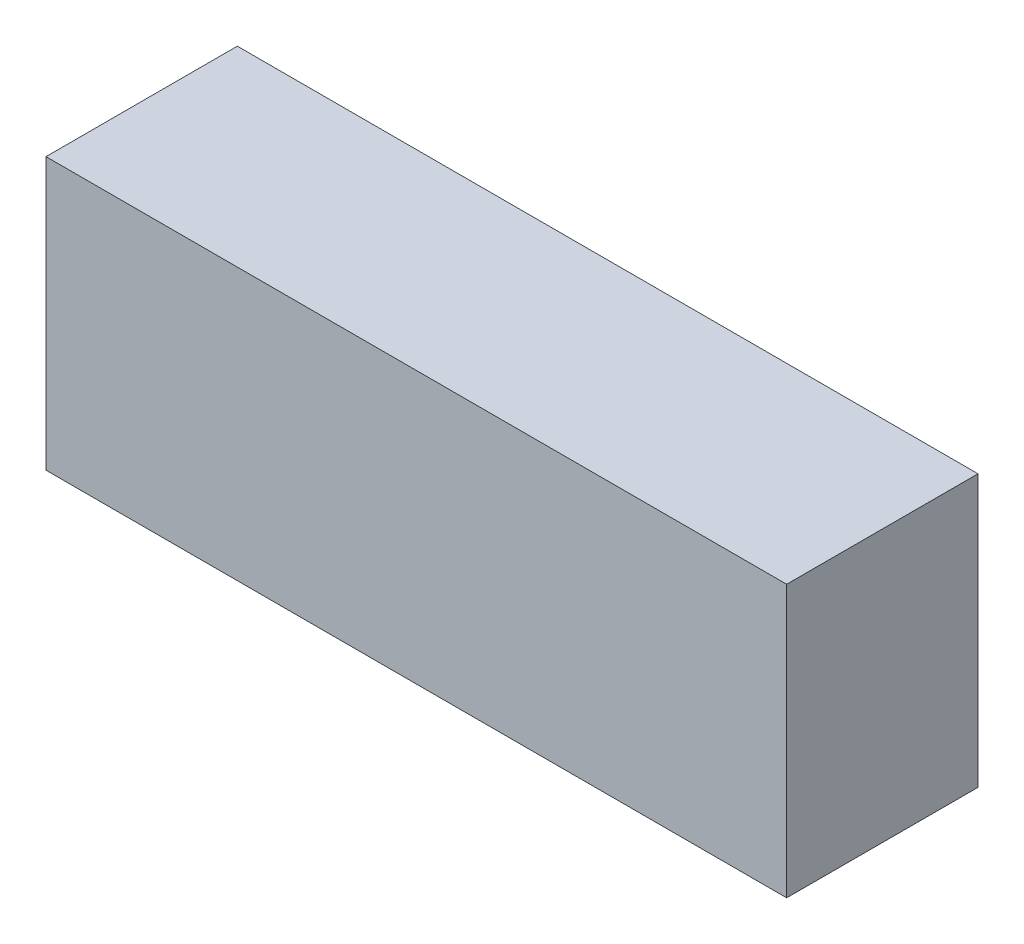
ISO-10303-21;
HEADER;
FILE_DESCRIPTION(('STEP AP214'),'2;1');
FILE_NAME('part.step','',(''),(''),'','','');
FILE_SCHEMA(('AUTOMOTIVE_DESIGN { 1 0 10303 214 1 1 1 1 }'));
ENDSEC;
DATA;
#1=APPLICATION_CONTEXT('core data for automotive mechanical design processes');
#2=APPLICATION_PROTOCOL_DEFINITION('international standard','automotive_design',2000,#1);
#3=PRODUCT_CONTEXT('',#1,'mechanical');
#4=PRODUCT('Part','Part','',(#3));
#5=PRODUCT_RELATED_PRODUCT_CATEGORY('part','',(#4));
#6=PRODUCT_DEFINITION_FORMATION('','',#4);
#7=PRODUCT_DEFINITION_CONTEXT('part definition',#1,'design');
#8=PRODUCT_DEFINITION('design','',#6,#7);
#9=PRODUCT_DEFINITION_SHAPE('','',#8);
#10=(LENGTH_UNIT() NAMED_UNIT(*) SI_UNIT(.MILLI.,.METRE.));
#11=(NAMED_UNIT(*) PLANE_ANGLE_UNIT() SI_UNIT($,.RADIAN.));
#12=(NAMED_UNIT(*) SI_UNIT($,.STERADIAN.) SOLID_ANGLE_UNIT());
#13=UNCERTAINTY_MEASURE_WITH_UNIT(LENGTH_MEASURE(1.E-05),#10,'distance_accuracy_value','');
#14=(GEOMETRIC_REPRESENTATION_CONTEXT(3) GLOBAL_UNCERTAINTY_ASSIGNED_CONTEXT((#13)) GLOBAL_UNIT_ASSIGNED_CONTEXT((#10,
#11,#12)) REPRESENTATION_CONTEXT('',''));
#15=CARTESIAN_POINT('',(0.,0.,0.));
#16=DIRECTION('',(0.,0.,1.));
#17=DIRECTION('',(1.,0.,0.));
#18=AXIS2_PLACEMENT_3D('',#15,#16,#17);
#19=CARTESIAN_POINT('',(-0.9,4.02,0.31));
#20=DIRECTION('',(0.,0.,1.));
#21=DIRECTION('',(1.,0.,0.));
#22=AXIS2_PLACEMENT_3D('',#19,#20,#21);
#23=PLANE('',#22);
#24=DIRECTION('',(1.,0.,0.));
#25=VECTOR('',#24,1.);
#26=CARTESIAN_POINT('',(-0.9,4.02,0.31));
#27=LINE('',#26,#25);
#28=CARTESIAN_POINT('',(-0.9,4.02,0.31));
#29=VERTEX_POINT('',#28);
#30=CARTESIAN_POINT('',(0.3,4.02,0.31));
#31=VERTEX_POINT('',#30);
#32=EDGE_CURVE('E70',#29,#31,#27,.T.);
#33=ORIENTED_EDGE('',*,*,#32,.F.);
#34=DIRECTION('',(0.,-1.,0.));
#35=VECTOR('',#34,1.);
#36=CARTESIAN_POINT('',(-0.9,4.02,0.31));
#37=LINE('',#36,#35);
#38=CARTESIAN_POINT('',(-0.9,3.58,0.31));
#39=VERTEX_POINT('',#38);
#40=EDGE_CURVE('E65',#29,#39,#37,.T.);
#41=ORIENTED_EDGE('',*,*,#40,.T.);
#42=DIRECTION('',(1.,0.,0.));
#43=VECTOR('',#42,1.);
#44=CARTESIAN_POINT('',(-0.9,3.58,0.31));
#45=LINE('',#44,#43);
#46=CARTESIAN_POINT('',(0.3,3.58,0.31));
#47=VERTEX_POINT('',#46);
#48=EDGE_CURVE('E67',#39,#47,#45,.T.);
#49=ORIENTED_EDGE('',*,*,#48,.T.);
#50=DIRECTION('',(0.,-1.,0.));
#51=VECTOR('',#50,1.);
#52=CARTESIAN_POINT('',(0.3,4.02,0.31));
#53=LINE('',#52,#51);
#54=EDGE_CURVE('E11',#31,#47,#53,.T.);
#55=ORIENTED_EDGE('',*,*,#54,.F.);
#56=EDGE_LOOP('',(#33,#41,#49,#55));
#57=FACE_BOUND('',#56,.T.);
#58=ADVANCED_FACE('F16',(#57),#23,.T.);
#59=CARTESIAN_POINT('',(-0.9,4.02,0.));
#60=DIRECTION('',(0.,0.,1.));
#61=DIRECTION('',(1.,0.,0.));
#62=AXIS2_PLACEMENT_3D('',#59,#60,#61);
#63=PLANE('',#62);
#64=DIRECTION('',(1.,0.,0.));
#65=VECTOR('',#64,1.);
#66=CARTESIAN_POINT('',(-0.9,4.02,0.));
#67=LINE('',#66,#65);
#68=CARTESIAN_POINT('',(-0.9,4.02,0.));
#69=VERTEX_POINT('',#68);
#70=CARTESIAN_POINT('',(0.3,4.02,0.));
#71=VERTEX_POINT('',#70);
#72=EDGE_CURVE('E89',#69,#71,#67,.T.);
#73=ORIENTED_EDGE('',*,*,#72,.T.);
#74=DIRECTION('',(0.,-1.,0.));
#75=VECTOR('',#74,1.);
#76=CARTESIAN_POINT('',(0.3,4.02,0.));
#77=LINE('',#76,#75);
#78=CARTESIAN_POINT('',(0.3,3.58,0.));
#79=VERTEX_POINT('',#78);
#80=EDGE_CURVE('E27',#71,#79,#77,.T.);
#81=ORIENTED_EDGE('',*,*,#80,.T.);
#82=DIRECTION('',(1.,0.,0.));
#83=VECTOR('',#82,1.);
#84=CARTESIAN_POINT('',(-0.9,3.58,0.));
#85=LINE('',#84,#83);
#86=CARTESIAN_POINT('',(-0.9,3.58,0.));
#87=VERTEX_POINT('',#86);
#88=EDGE_CURVE('E88',#87,#79,#85,.T.);
#89=ORIENTED_EDGE('',*,*,#88,.F.);
#90=DIRECTION('',(0.,-1.,0.));
#91=VECTOR('',#90,1.);
#92=CARTESIAN_POINT('',(-0.9,4.02,0.));
#93=LINE('',#92,#91);
#94=EDGE_CURVE('E76',#69,#87,#93,.T.);
#95=ORIENTED_EDGE('',*,*,#94,.F.);
#96=EDGE_LOOP('',(#73,#81,#89,#95));
#97=FACE_BOUND('',#96,.T.);
#98=ADVANCED_FACE('F155',(#97),#63,.F.);
#99=CARTESIAN_POINT('',(0.3,4.02,0.));
#100=DIRECTION('',(1.,0.,0.));
#101=DIRECTION('',(0.,1.,0.));
#102=AXIS2_PLACEMENT_3D('',#99,#100,#101);
#103=PLANE('',#102);
#104=ORIENTED_EDGE('',*,*,#80,.F.);
#105=DIRECTION('',(0.,0.,1.));
#106=VECTOR('',#105,1.);
#107=CARTESIAN_POINT('',(0.3,4.02,0.));
#108=LINE('',#107,#106);
#109=EDGE_CURVE('E98',#71,#31,#108,.T.);
#110=ORIENTED_EDGE('',*,*,#109,.T.);
#111=ORIENTED_EDGE('',*,*,#54,.T.);
#112=DIRECTION('',(0.,0.,1.));
#113=VECTOR('',#112,1.);
#114=CARTESIAN_POINT('',(0.3,3.58,0.));
#115=LINE('',#114,#113);
#116=EDGE_CURVE('E82',#79,#47,#115,.T.);
#117=ORIENTED_EDGE('',*,*,#116,.F.);
#118=EDGE_LOOP('',(#104,#110,#111,#117));
#119=FACE_BOUND('',#118,.T.);
#120=ADVANCED_FACE('F157',(#119),#103,.T.);
#121=CARTESIAN_POINT('',(-0.9,4.02,0.));
#122=DIRECTION('',(1.,0.,0.));
#123=DIRECTION('',(0.,1.,0.));
#124=AXIS2_PLACEMENT_3D('',#121,#122,#123);
#125=PLANE('',#124);
#126=ORIENTED_EDGE('',*,*,#94,.T.);
#127=DIRECTION('',(0.,0.,1.));
#128=VECTOR('',#127,1.);
#129=CARTESIAN_POINT('',(-0.9,3.58,0.));
#130=LINE('',#129,#128);
#131=EDGE_CURVE('E81',#87,#39,#130,.T.);
#132=ORIENTED_EDGE('',*,*,#131,.T.);
#133=ORIENTED_EDGE('',*,*,#40,.F.);
#134=DIRECTION('',(0.,0.,1.));
#135=VECTOR('',#134,1.);
#136=CARTESIAN_POINT('',(-0.9,4.02,0.));
#137=LINE('',#136,#135);
#138=EDGE_CURVE('E20',#69,#29,#137,.T.);
#139=ORIENTED_EDGE('',*,*,#138,.F.);
#140=EDGE_LOOP('',(#126,#132,#133,#139));
#141=FACE_BOUND('',#140,.T.);
#142=ADVANCED_FACE('F85',(#141),#125,.F.);
#143=CARTESIAN_POINT('',(-0.9,3.58,0.));
#144=DIRECTION('',(0.,-1.,0.));
#145=DIRECTION('',(0.,0.,-1.));
#146=AXIS2_PLACEMENT_3D('',#143,#144,#145);
#147=PLANE('',#146);
#148=ORIENTED_EDGE('',*,*,#131,.F.);
#149=ORIENTED_EDGE('',*,*,#88,.T.);
#150=ORIENTED_EDGE('',*,*,#116,.T.);
#151=ORIENTED_EDGE('',*,*,#48,.F.);
#152=EDGE_LOOP('',(#148,#149,#150,#151));
#153=FACE_BOUND('',#152,.T.);
#154=ADVANCED_FACE('F18',(#153),#147,.T.);
#155=CARTESIAN_POINT('',(-0.9,4.02,0.));
#156=DIRECTION('',(0.,-1.,0.));
#157=DIRECTION('',(0.,0.,-1.));
#158=AXIS2_PLACEMENT_3D('',#155,#156,#157);
#159=PLANE('',#158);
#160=ORIENTED_EDGE('',*,*,#138,.T.);
#161=ORIENTED_EDGE('',*,*,#32,.T.);
#162=ORIENTED_EDGE('',*,*,#109,.F.);
#163=ORIENTED_EDGE('',*,*,#72,.F.);
#164=EDGE_LOOP('',(#160,#161,#162,#163));
#165=FACE_BOUND('',#164,.T.);
#166=ADVANCED_FACE('F116',(#165),#159,.F.);
#167=CLOSED_SHELL('',(#58,#98,#120,#142,#154,#166));
#168=MANIFOLD_SOLID_BREP('B1',#167);
#169=ADVANCED_BREP_SHAPE_REPRESENTATION('',(#18,#168),#14);
#170=SHAPE_DEFINITION_REPRESENTATION(#9,#169);
ENDSEC;
END-ISO-10303-21;
